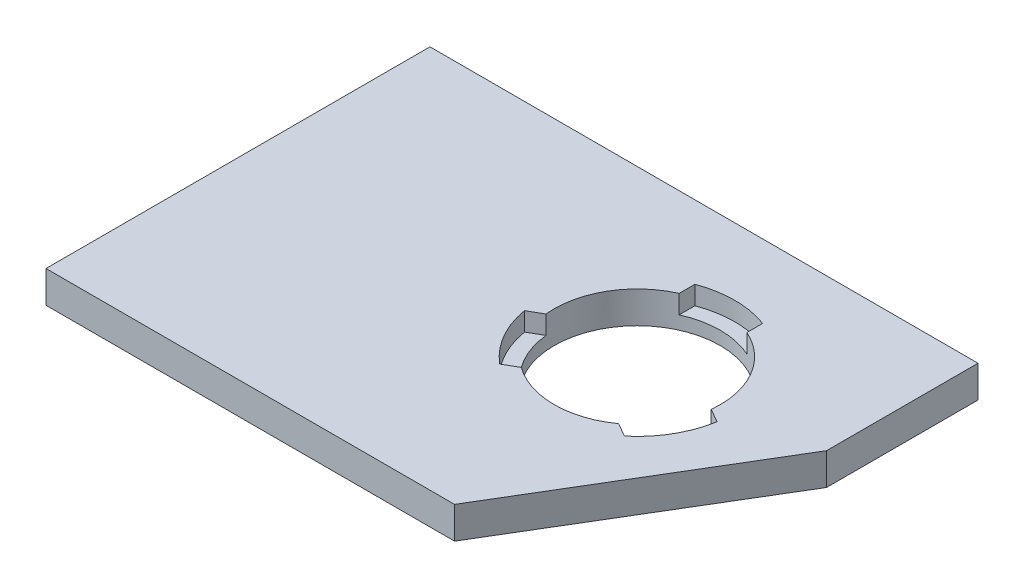
ISO-10303-21;
HEADER;
FILE_DESCRIPTION(('STEP AP214'),'2;1');
FILE_NAME('part.step','',(''),(''),'','','');
FILE_SCHEMA(('AUTOMOTIVE_DESIGN { 1 0 10303 214 1 1 1 1 }'));
ENDSEC;
DATA;
#1=APPLICATION_CONTEXT('core data for automotive mechanical design processes');
#2=APPLICATION_PROTOCOL_DEFINITION('international standard','automotive_design',2000,#1);
#3=PRODUCT_CONTEXT('',#1,'mechanical');
#4=PRODUCT('Part','Part','',(#3));
#5=PRODUCT_RELATED_PRODUCT_CATEGORY('part','',(#4));
#6=PRODUCT_DEFINITION_FORMATION('','',#4);
#7=PRODUCT_DEFINITION_CONTEXT('part definition',#1,'design');
#8=PRODUCT_DEFINITION('design','',#6,#7);
#9=PRODUCT_DEFINITION_SHAPE('','',#8);
#10=(LENGTH_UNIT() NAMED_UNIT(*) SI_UNIT(.MILLI.,.METRE.));
#11=(NAMED_UNIT(*) PLANE_ANGLE_UNIT() SI_UNIT($,.RADIAN.));
#12=(NAMED_UNIT(*) SI_UNIT($,.STERADIAN.) SOLID_ANGLE_UNIT());
#13=UNCERTAINTY_MEASURE_WITH_UNIT(LENGTH_MEASURE(1.E-05),#10,'distance_accuracy_value','');
#14=(GEOMETRIC_REPRESENTATION_CONTEXT(3) GLOBAL_UNCERTAINTY_ASSIGNED_CONTEXT((#13)) GLOBAL_UNIT_ASSIGNED_CONTEXT((#10,
#11,#12)) REPRESENTATION_CONTEXT('',''));
#15=CARTESIAN_POINT('',(0.,0.,0.));
#16=DIRECTION('',(0.,0.,1.));
#17=DIRECTION('',(1.,0.,0.));
#18=AXIS2_PLACEMENT_3D('',#15,#16,#17);
#19=CARTESIAN_POINT('',(0.,4.8,0.));
#20=DIRECTION('',(0.,-1.,0.));
#21=DIRECTION('',(0.,0.,-1.));
#22=AXIS2_PLACEMENT_3D('',#19,#20,#21);
#23=PLANE('',#22);
#24=DIRECTION('',(1.,0.,0.));
#25=VECTOR('',#24,1.);
#26=CARTESIAN_POINT('',(-20.3661087866109,4.8,10.1640167364017));
#27=LINE('',#26,#25);
#28=CARTESIAN_POINT('',(-20.3661087866109,4.8,10.1640167364017));
#29=VERTEX_POINT('',#28);
#30=CARTESIAN_POINT('',(41.1338912133891,4.8,10.1640167364017));
#31=VERTEX_POINT('',#30);
#32=EDGE_CURVE('E296',#29,#31,#27,.T.);
#33=ORIENTED_EDGE('',*,*,#32,.T.);
#34=DIRECTION('',(-0.514495755427526,0.,0.857492925712544));
#35=VECTOR('',#34,1.);
#36=CARTESIAN_POINT('',(41.1338912133891,4.8,10.1640167364017));
#37=LINE('',#36,#35);
#38=CARTESIAN_POINT('',(62.1338912133891,4.8,-24.8359832635983));
#39=VERTEX_POINT('',#38);
#40=EDGE_CURVE('E271',#39,#31,#37,.T.);
#41=ORIENTED_EDGE('',*,*,#40,.F.);
#42=DIRECTION('',(0.,0.,-1.));
#43=VECTOR('',#42,1.);
#44=CARTESIAN_POINT('',(62.1338912133891,4.8,10.1640167364017));
#45=LINE('',#44,#43);
#46=CARTESIAN_POINT('',(62.1338912133891,4.8,-47.6359832635983));
#47=VERTEX_POINT('',#46);
#48=EDGE_CURVE('E301',#39,#47,#45,.T.);
#49=ORIENTED_EDGE('',*,*,#48,.T.);
#50=DIRECTION('',(-1.,0.,0.));
#51=VECTOR('',#50,1.);
#52=CARTESIAN_POINT('',(-20.3661087866109,4.8,-47.6359832635983));
#53=LINE('',#52,#51);
#54=CARTESIAN_POINT('',(-20.3661087866109,4.8,-47.6359832635983));
#55=VERTEX_POINT('',#54);
#56=EDGE_CURVE('E304',#47,#55,#53,.T.);
#57=ORIENTED_EDGE('',*,*,#56,.T.);
#58=DIRECTION('',(0.,0.,1.));
#59=VECTOR('',#58,1.);
#60=CARTESIAN_POINT('',(-20.3661087866109,4.8,10.1640167364017));
#61=LINE('',#60,#59);
#62=EDGE_CURVE('E292',#55,#29,#61,.T.);
#63=ORIENTED_EDGE('',*,*,#62,.T.);
#64=EDGE_LOOP('',(#33,#41,#49,#57,#63));
#65=FACE_BOUND('',#64,.T.);
#66=DIRECTION('',(0.,0.,-1.));
#67=VECTOR('',#66,1.);
#68=CARTESIAN_POINT('',(30.5338912133891,4.8,0.));
#69=LINE('',#68,#67);
#70=CARTESIAN_POINT('',(30.5338912133891,4.8,-34.248257357748));
#71=VERTEX_POINT('',#70);
#72=CARTESIAN_POINT('',(30.5338912133891,4.8,-36.6229336152896));
#73=VERTEX_POINT('',#72);
#74=EDGE_CURVE('E176',#71,#73,#69,.T.);
#75=ORIENTED_EDGE('',*,*,#74,.T.);
#76=CARTESIAN_POINT('',(35.6338912133891,4.8,-22.8359832635983));
#77=DIRECTION('',(0.,1.,0.));
#78=DIRECTION('',(0.,0.,1.));
#79=AXIS2_PLACEMENT_3D('',#76,#77,#78);
#80=CIRCLE('',#79,14.7);
#81=CARTESIAN_POINT('',(40.7338912133891,4.8,-36.6229336152896));
#82=VERTEX_POINT('',#81);
#83=EDGE_CURVE('E539',#82,#73,#80,.T.);
#84=ORIENTED_EDGE('',*,*,#83,.F.);
#85=DIRECTION('',(0.,0.,1.));
#86=VECTOR('',#85,1.);
#87=CARTESIAN_POINT('',(40.7338912133891,4.8,0.));
#88=LINE('',#87,#86);
#89=CARTESIAN_POINT('',(40.7338912133891,4.8,-34.248257357748));
#90=VERTEX_POINT('',#89);
#91=EDGE_CURVE('E220',#82,#90,#88,.T.);
#92=ORIENTED_EDGE('',*,*,#91,.T.);
#93=CARTESIAN_POINT('',(35.6338912133891,4.8,-22.8359832635983));
#94=DIRECTION('',(0.,1.,0.));
#95=DIRECTION('',(0.,0.,1.));
#96=AXIS2_PLACEMENT_3D('',#93,#94,#95);
#97=CIRCLE('',#96,12.5);
#98=CARTESIAN_POINT('',(48.0672104938738,4.8,-21.5465757758243));
#99=VERTEX_POINT('',#98);
#100=EDGE_CURVE('E182',#99,#90,#97,.T.);
#101=ORIENTED_EDGE('',*,*,#100,.F.);
#102=DIRECTION('',(0.866025403784437,0.,0.500000000000003));
#103=VECTOR('',#102,1.);
#104=CARTESIAN_POINT('',(21.3467436166838,4.8,-36.9736445202426));
#105=LINE('',#104,#103);
#106=CARTESIAN_POINT('',(50.1237404586686,4.8,-20.3592376470535));
#107=VERTEX_POINT('',#106);
#108=EDGE_CURVE('E196',#99,#107,#105,.T.);
#109=ORIENTED_EDGE('',*,*,#108,.T.);
#110=CARTESIAN_POINT('',(35.6338912133891,4.8,-22.8359832635983));
#111=DIRECTION('',(0.,1.,0.));
#112=DIRECTION('',(0.,0.,1.));
#113=AXIS2_PLACEMENT_3D('',#110,#111,#112);
#114=CIRCLE('',#113,14.7);
#115=CARTESIAN_POINT('',(45.0237404586687,4.8,-11.5257785284522));
#116=VERTEX_POINT('',#115);
#117=EDGE_CURVE('E209',#116,#107,#114,.T.);
#118=ORIENTED_EDGE('',*,*,#117,.F.);
#119=DIRECTION('',(-0.866025403784437,0.,-0.500000000000004));
#120=VECTOR('',#119,1.);
#121=CARTESIAN_POINT('',(16.2467436166838,4.8,-28.1401854016413));
#122=LINE('',#121,#120);
#123=CARTESIAN_POINT('',(42.967210493874,4.8,-12.713116657223));
#124=VERTEX_POINT('',#123);
#125=EDGE_CURVE('E205',#116,#124,#122,.T.);
#126=ORIENTED_EDGE('',*,*,#125,.T.);
#127=CARTESIAN_POINT('',(28.3005719329048,4.8,-12.7131166572226));
#128=VERTEX_POINT('',#127);
#129=EDGE_CURVE('E272',#128,#124,#97,.T.);
#130=ORIENTED_EDGE('',*,*,#129,.F.);
#131=DIRECTION('',(-0.866025403784444,0.,0.499999999999992));
#132=VECTOR('',#131,1.);
#133=CARTESIAN_POINT('',(1.57020199001108,4.8,2.71966962484501));
#134=LINE('',#133,#132);
#135=CARTESIAN_POINT('',(26.24404196811,4.8,-11.5257785284518));
#136=VERTEX_POINT('',#135);
#137=EDGE_CURVE('E233',#128,#136,#134,.T.);
#138=ORIENTED_EDGE('',*,*,#137,.T.);
#139=CARTESIAN_POINT('',(35.6338912133891,4.8,-22.8359832635983));
#140=DIRECTION('',(0.,1.,0.));
#141=DIRECTION('',(0.,0.,1.));
#142=AXIS2_PLACEMENT_3D('',#139,#140,#141);
#143=CIRCLE('',#142,14.7);
#144=CARTESIAN_POINT('',(21.1440419681098,4.8,-20.359237647053));
#145=VERTEX_POINT('',#144);
#146=EDGE_CURVE('E249',#145,#136,#143,.T.);
#147=ORIENTED_EDGE('',*,*,#146,.F.);
#148=DIRECTION('',(0.866025403784443,0.,-0.499999999999992));
#149=VECTOR('',#148,1.);
#150=CARTESIAN_POINT('',(-3.52979800998883,4.8,-6.1137894937563));
#151=LINE('',#150,#149);
#152=CARTESIAN_POINT('',(23.2005719329045,4.8,-21.5465757758237));
#153=VERTEX_POINT('',#152);
#154=EDGE_CURVE('E245',#145,#153,#151,.T.);
#155=ORIENTED_EDGE('',*,*,#154,.T.);
#156=EDGE_CURVE('E276',#71,#153,#97,.T.);
#157=ORIENTED_EDGE('',*,*,#156,.F.);
#158=EDGE_LOOP('',(#75,#84,#92,#101,#109,#118,#126,#130,#138,#147,#155,#157));
#159=FACE_BOUND('',#158,.T.);
#160=ADVANCED_FACE('F38',(#65,#159),#23,.F.);
#161=CARTESIAN_POINT('',(35.6338912133891,0.,-22.8359832635983));
#162=DIRECTION('',(0.,1.,0.));
#163=DIRECTION('',(0.,0.,1.));
#164=AXIS2_PLACEMENT_3D('',#161,#162,#163);
#165=CYLINDRICAL_SURFACE('',#164,12.5);
#166=CARTESIAN_POINT('',(35.6338912133891,0.,-22.8359832635983));
#167=DIRECTION('',(0.,1.,0.));
#168=DIRECTION('',(0.,0.,1.));
#169=AXIS2_PLACEMENT_3D('',#166,#167,#168);
#170=CIRCLE('',#169,12.5);
#171=CARTESIAN_POINT('',(35.6338912133891,0.,-10.3359832635983));
#172=VERTEX_POINT('',#171);
#173=EDGE_CURVE('E267',#172,#172,#170,.T.);
#174=ORIENTED_EDGE('',*,*,#173,.F.);
#175=EDGE_LOOP('',(#174));
#176=FACE_BOUND('',#175,.T.);
#177=DIRECTION('',(0.,1.,0.));
#178=VECTOR('',#177,1.);
#179=CARTESIAN_POINT('',(30.5338912133891,2.,-34.248257357748));
#180=LINE('',#179,#178);
#181=CARTESIAN_POINT('',(30.5338912133891,2.,-34.248257357748));
#182=VERTEX_POINT('',#181);
#183=EDGE_CURVE('E277',#182,#71,#180,.T.);
#184=ORIENTED_EDGE('',*,*,#183,.T.);
#185=ORIENTED_EDGE('',*,*,#156,.T.);
#186=DIRECTION('',(0.,1.,0.));
#187=VECTOR('',#186,1.);
#188=CARTESIAN_POINT('',(23.2005719329045,2.,-21.5465757758237));
#189=LINE('',#188,#187);
#190=CARTESIAN_POINT('',(23.2005719329045,2.,-21.5465757758237));
#191=VERTEX_POINT('',#190);
#192=EDGE_CURVE('E210',#191,#153,#189,.T.);
#193=ORIENTED_EDGE('',*,*,#192,.F.);
#194=CARTESIAN_POINT('',(35.6338912133891,2.,-22.8359832635983));
#195=DIRECTION('',(0.,1.,0.));
#196=DIRECTION('',(0.,0.,1.));
#197=AXIS2_PLACEMENT_3D('',#194,#195,#196);
#198=CIRCLE('',#197,12.5);
#199=CARTESIAN_POINT('',(28.3005719329048,2.,-12.7131166572226));
#200=VERTEX_POINT('',#199);
#201=EDGE_CURVE('E240',#200,#191,#198,.F.);
#202=ORIENTED_EDGE('',*,*,#201,.F.);
#203=DIRECTION('',(0.,1.,0.));
#204=VECTOR('',#203,1.);
#205=CARTESIAN_POINT('',(28.3005719329048,2.,-12.7131166572226));
#206=LINE('',#205,#204);
#207=EDGE_CURVE('E258',#200,#128,#206,.T.);
#208=ORIENTED_EDGE('',*,*,#207,.T.);
#209=ORIENTED_EDGE('',*,*,#129,.T.);
#210=DIRECTION('',(0.,1.,0.));
#211=VECTOR('',#210,1.);
#212=CARTESIAN_POINT('',(42.967210493874,2.,-12.713116657223));
#213=LINE('',#212,#211);
#214=CARTESIAN_POINT('',(42.967210493874,2.,-12.713116657223));
#215=VERTEX_POINT('',#214);
#216=EDGE_CURVE('E204',#215,#124,#213,.T.);
#217=ORIENTED_EDGE('',*,*,#216,.F.);
#218=CARTESIAN_POINT('',(35.6338912133891,2.,-22.8359832635983));
#219=DIRECTION('',(0.,1.,0.));
#220=DIRECTION('',(0.,0.,1.));
#221=AXIS2_PLACEMENT_3D('',#218,#219,#220);
#222=CIRCLE('',#221,12.5);
#223=CARTESIAN_POINT('',(48.0672104938738,2.,-21.5465757758243));
#224=VERTEX_POINT('',#223);
#225=EDGE_CURVE('E192',#224,#215,#222,.F.);
#226=ORIENTED_EDGE('',*,*,#225,.F.);
#227=DIRECTION('',(0.,1.,0.));
#228=VECTOR('',#227,1.);
#229=CARTESIAN_POINT('',(48.0672104938738,2.,-21.5465757758243));
#230=LINE('',#229,#228);
#231=EDGE_CURVE('E217',#224,#99,#230,.T.);
#232=ORIENTED_EDGE('',*,*,#231,.T.);
#233=ORIENTED_EDGE('',*,*,#100,.T.);
#234=DIRECTION('',(0.,1.,0.));
#235=VECTOR('',#234,1.);
#236=CARTESIAN_POINT('',(40.7338912133891,2.,-34.248257357748));
#237=LINE('',#236,#235);
#238=CARTESIAN_POINT('',(40.7338912133891,2.,-34.248257357748));
#239=VERTEX_POINT('',#238);
#240=EDGE_CURVE('E163',#239,#90,#237,.T.);
#241=ORIENTED_EDGE('',*,*,#240,.F.);
#242=CARTESIAN_POINT('',(35.6338912133891,2.,-22.8359832635983));
#243=DIRECTION('',(0.,1.,0.));
#244=DIRECTION('',(0.,0.,1.));
#245=AXIS2_PLACEMENT_3D('',#242,#243,#244);
#246=CIRCLE('',#245,12.5);
#247=EDGE_CURVE('E169',#182,#239,#246,.F.);
#248=ORIENTED_EDGE('',*,*,#247,.F.);
#249=EDGE_LOOP('',(#184,#185,#193,#202,#208,#209,#217,#226,#232,#233,#241,#248));
#250=FACE_BOUND('',#249,.T.);
#251=ADVANCED_FACE('F179',(#176,#250),#165,.F.);
#252=CARTESIAN_POINT('',(-20.3661087866109,4.8,10.1640167364017));
#253=DIRECTION('',(1.,0.,0.));
#254=DIRECTION('',(0.,0.,-1.));
#255=AXIS2_PLACEMENT_3D('',#252,#253,#254);
#256=PLANE('',#255);
#257=DIRECTION('',(0.,0.,1.));
#258=VECTOR('',#257,1.);
#259=CARTESIAN_POINT('',(-20.3661087866109,0.,10.1640167364017));
#260=LINE('',#259,#258);
#261=CARTESIAN_POINT('',(-20.3661087866109,0.,-47.6359832635983));
#262=VERTEX_POINT('',#261);
#263=CARTESIAN_POINT('',(-20.3661087866109,0.,10.1640167364017));
#264=VERTEX_POINT('',#263);
#265=EDGE_CURVE('E289',#262,#264,#260,.T.);
#266=ORIENTED_EDGE('',*,*,#265,.T.);
#267=DIRECTION('',(0.,-1.,0.));
#268=VECTOR('',#267,1.);
#269=CARTESIAN_POINT('',(-20.3661087866109,4.8,10.1640167364017));
#270=LINE('',#269,#268);
#271=EDGE_CURVE('E11',#29,#264,#270,.T.);
#272=ORIENTED_EDGE('',*,*,#271,.F.);
#273=ORIENTED_EDGE('',*,*,#62,.F.);
#274=DIRECTION('',(0.,-1.,0.));
#275=VECTOR('',#274,1.);
#276=CARTESIAN_POINT('',(-20.3661087866109,4.8,-47.6359832635983));
#277=LINE('',#276,#275);
#278=EDGE_CURVE('E307',#55,#262,#277,.T.);
#279=ORIENTED_EDGE('',*,*,#278,.T.);
#280=EDGE_LOOP('',(#266,#272,#273,#279));
#281=FACE_BOUND('',#280,.T.);
#282=ADVANCED_FACE('F40',(#281),#256,.F.);
#283=CARTESIAN_POINT('',(-20.3661087866109,4.8,10.1640167364017));
#284=DIRECTION('',(0.,0.,-1.));
#285=DIRECTION('',(-1.,0.,0.));
#286=AXIS2_PLACEMENT_3D('',#283,#284,#285);
#287=PLANE('',#286);
#288=DIRECTION('',(1.,0.,0.));
#289=VECTOR('',#288,1.);
#290=CARTESIAN_POINT('',(-20.3661087866109,0.,10.1640167364017));
#291=LINE('',#290,#289);
#292=CARTESIAN_POINT('',(41.1338912133891,0.,10.1640167364017));
#293=VERTEX_POINT('',#292);
#294=EDGE_CURVE('E311',#264,#293,#291,.T.);
#295=ORIENTED_EDGE('',*,*,#294,.T.);
#296=DIRECTION('',(0.,1.,0.));
#297=VECTOR('',#296,1.);
#298=CARTESIAN_POINT('',(41.1338912133891,0.,10.1640167364017));
#299=LINE('',#298,#297);
#300=EDGE_CURVE('E285',#293,#31,#299,.T.);
#301=ORIENTED_EDGE('',*,*,#300,.T.);
#302=ORIENTED_EDGE('',*,*,#32,.F.);
#303=ORIENTED_EDGE('',*,*,#271,.T.);
#304=EDGE_LOOP('',(#295,#301,#302,#303));
#305=FACE_BOUND('',#304,.T.);
#306=ADVANCED_FACE('F347',(#305),#287,.F.);
#307=CARTESIAN_POINT('',(62.1338912133891,4.8,10.1640167364017));
#308=DIRECTION('',(-1.,0.,0.));
#309=DIRECTION('',(0.,0.,1.));
#310=AXIS2_PLACEMENT_3D('',#307,#308,#309);
#311=PLANE('',#310);
#312=ORIENTED_EDGE('',*,*,#48,.F.);
#313=DIRECTION('',(0.,1.,0.));
#314=VECTOR('',#313,1.);
#315=CARTESIAN_POINT('',(62.1338912133891,0.,-24.8359832635983));
#316=LINE('',#315,#314);
#317=CARTESIAN_POINT('',(62.1338912133891,0.,-24.8359832635983));
#318=VERTEX_POINT('',#317);
#319=EDGE_CURVE('E282',#318,#39,#316,.T.);
#320=ORIENTED_EDGE('',*,*,#319,.F.);
#321=DIRECTION('',(0.,0.,-1.));
#322=VECTOR('',#321,1.);
#323=CARTESIAN_POINT('',(62.1338912133891,0.,10.1640167364017));
#324=LINE('',#323,#322);
#325=CARTESIAN_POINT('',(62.1338912133891,0.,-47.6359832635983));
#326=VERTEX_POINT('',#325);
#327=EDGE_CURVE('E315',#318,#326,#324,.T.);
#328=ORIENTED_EDGE('',*,*,#327,.T.);
#329=DIRECTION('',(0.,-1.,0.));
#330=VECTOR('',#329,1.);
#331=CARTESIAN_POINT('',(62.1338912133891,4.8,-47.6359832635983));
#332=LINE('',#331,#330);
#333=EDGE_CURVE('E47',#47,#326,#332,.T.);
#334=ORIENTED_EDGE('',*,*,#333,.F.);
#335=EDGE_LOOP('',(#312,#320,#328,#334));
#336=FACE_BOUND('',#335,.T.);
#337=ADVANCED_FACE('F343',(#336),#311,.F.);
#338=CARTESIAN_POINT('',(-20.3661087866109,4.8,-47.6359832635983));
#339=DIRECTION('',(0.,0.,1.));
#340=DIRECTION('',(1.,0.,0.));
#341=AXIS2_PLACEMENT_3D('',#338,#339,#340);
#342=PLANE('',#341);
#343=DIRECTION('',(-1.,0.,0.));
#344=VECTOR('',#343,1.);
#345=CARTESIAN_POINT('',(-20.3661087866109,0.,-47.6359832635983));
#346=LINE('',#345,#344);
#347=EDGE_CURVE('E297',#326,#262,#346,.T.);
#348=ORIENTED_EDGE('',*,*,#347,.T.);
#349=ORIENTED_EDGE('',*,*,#278,.F.);
#350=ORIENTED_EDGE('',*,*,#56,.F.);
#351=ORIENTED_EDGE('',*,*,#333,.T.);
#352=EDGE_LOOP('',(#348,#349,#350,#351));
#353=FACE_BOUND('',#352,.T.);
#354=ADVANCED_FACE('F328',(#353),#342,.F.);
#355=CARTESIAN_POINT('',(0.,0.,0.));
#356=DIRECTION('',(0.,-1.,0.));
#357=DIRECTION('',(0.,0.,-1.));
#358=AXIS2_PLACEMENT_3D('',#355,#356,#357);
#359=PLANE('',#358);
#360=ORIENTED_EDGE('',*,*,#173,.T.);
#361=EDGE_LOOP('',(#360));
#362=FACE_BOUND('',#361,.T.);
#363=DIRECTION('',(-0.514495755427526,0.,0.857492925712544));
#364=VECTOR('',#363,1.);
#365=CARTESIAN_POINT('',(41.1338912133891,0.,10.1640167364017));
#366=LINE('',#365,#364);
#367=EDGE_CURVE('E278',#318,#293,#366,.T.);
#368=ORIENTED_EDGE('',*,*,#367,.T.);
#369=ORIENTED_EDGE('',*,*,#294,.F.);
#370=ORIENTED_EDGE('',*,*,#265,.F.);
#371=ORIENTED_EDGE('',*,*,#347,.F.);
#372=ORIENTED_EDGE('',*,*,#327,.F.);
#373=EDGE_LOOP('',(#368,#369,#370,#371,#372));
#374=FACE_BOUND('',#373,.T.);
#375=ADVANCED_FACE('F335',(#362,#374),#359,.T.);
#376=CARTESIAN_POINT('',(41.1338912133891,0.,10.1640167364017));
#377=DIRECTION('',(-0.857492925712544,0.,-0.514495755427526));
#378=DIRECTION('',(-0.514495755427527,0.,0.857492925712544));
#379=AXIS2_PLACEMENT_3D('',#376,#377,#378);
#380=PLANE('',#379);
#381=ORIENTED_EDGE('',*,*,#40,.T.);
#382=ORIENTED_EDGE('',*,*,#300,.F.);
#383=ORIENTED_EDGE('',*,*,#367,.F.);
#384=ORIENTED_EDGE('',*,*,#319,.T.);
#385=EDGE_LOOP('',(#381,#382,#383,#384));
#386=FACE_BOUND('',#385,.T.);
#387=ADVANCED_FACE('F345',(#386),#380,.F.);
#388=CARTESIAN_POINT('',(-3.52979800998883,2.,-6.1137894937563));
#389=DIRECTION('',(0.499999999999992,0.,0.866025403784443));
#390=DIRECTION('',(0.866025403784443,0.,-0.499999999999992));
#391=AXIS2_PLACEMENT_3D('',#388,#389,#390);
#392=PLANE('',#391);
#393=ORIENTED_EDGE('',*,*,#154,.F.);
#394=DIRECTION('',(0.,1.,0.));
#395=VECTOR('',#394,1.);
#396=CARTESIAN_POINT('',(21.1440419681098,2.,-20.359237647053));
#397=LINE('',#396,#395);
#398=CARTESIAN_POINT('',(21.1440419681098,2.,-20.359237647053));
#399=VERTEX_POINT('',#398);
#400=EDGE_CURVE('E244',#399,#145,#397,.T.);
#401=ORIENTED_EDGE('',*,*,#400,.F.);
#402=DIRECTION('',(0.866025403784443,0.,-0.499999999999992));
#403=VECTOR('',#402,1.);
#404=CARTESIAN_POINT('',(-3.52979800998883,2.,-6.1137894937563));
#405=LINE('',#404,#403);
#406=EDGE_CURVE('E229',#399,#191,#405,.T.);
#407=ORIENTED_EDGE('',*,*,#406,.T.);
#408=ORIENTED_EDGE('',*,*,#192,.T.);
#409=EDGE_LOOP('',(#393,#401,#407,#408));
#410=FACE_BOUND('',#409,.T.);
#411=ADVANCED_FACE('F382',(#410),#392,.T.);
#412=CARTESIAN_POINT('',(1.57020199001108,2.,2.71966962484501));
#413=DIRECTION('',(-0.499999999999992,0.,-0.866025403784444));
#414=DIRECTION('',(-0.866025403784444,0.,0.499999999999992));
#415=AXIS2_PLACEMENT_3D('',#412,#413,#414);
#416=PLANE('',#415);
#417=ORIENTED_EDGE('',*,*,#137,.F.);
#418=ORIENTED_EDGE('',*,*,#207,.F.);
#419=DIRECTION('',(-0.866025403784444,0.,0.499999999999992));
#420=VECTOR('',#419,1.);
#421=CARTESIAN_POINT('',(1.57020199001108,2.,2.71966962484501));
#422=LINE('',#421,#420);
#423=CARTESIAN_POINT('',(26.24404196811,2.,-11.5257785284518));
#424=VERTEX_POINT('',#423);
#425=EDGE_CURVE('E237',#200,#424,#422,.T.);
#426=ORIENTED_EDGE('',*,*,#425,.T.);
#427=DIRECTION('',(0.,1.,0.));
#428=VECTOR('',#427,1.);
#429=CARTESIAN_POINT('',(26.24404196811,2.,-11.5257785284518));
#430=LINE('',#429,#428);
#431=EDGE_CURVE('E262',#424,#136,#430,.T.);
#432=ORIENTED_EDGE('',*,*,#431,.T.);
#433=EDGE_LOOP('',(#417,#418,#426,#432));
#434=FACE_BOUND('',#433,.T.);
#435=ADVANCED_FACE('F388',(#434),#416,.T.);
#436=CARTESIAN_POINT('',(35.6338912133891,2.,-22.8359832635983));
#437=DIRECTION('',(0.,1.,0.));
#438=DIRECTION('',(0.,0.,1.));
#439=AXIS2_PLACEMENT_3D('',#436,#437,#438);
#440=CYLINDRICAL_SURFACE('',#439,14.7);
#441=ORIENTED_EDGE('',*,*,#146,.T.);
#442=ORIENTED_EDGE('',*,*,#431,.F.);
#443=CARTESIAN_POINT('',(35.6338912133891,2.,-22.8359832635983));
#444=DIRECTION('',(0.,1.,0.));
#445=DIRECTION('',(0.,0.,1.));
#446=AXIS2_PLACEMENT_3D('',#443,#444,#445);
#447=CIRCLE('',#446,14.7);
#448=EDGE_CURVE('E232',#399,#424,#447,.T.);
#449=ORIENTED_EDGE('',*,*,#448,.F.);
#450=ORIENTED_EDGE('',*,*,#400,.T.);
#451=EDGE_LOOP('',(#441,#442,#449,#450));
#452=FACE_BOUND('',#451,.T.);
#453=ADVANCED_FACE('F397',(#452),#440,.F.);
#454=CARTESIAN_POINT('',(0.,2.,0.));
#455=DIRECTION('',(0.,1.,0.));
#456=DIRECTION('',(0.,0.,1.));
#457=AXIS2_PLACEMENT_3D('',#454,#455,#456);
#458=PLANE('',#457);
#459=ORIENTED_EDGE('',*,*,#406,.F.);
#460=ORIENTED_EDGE('',*,*,#448,.T.);
#461=ORIENTED_EDGE('',*,*,#425,.F.);
#462=ORIENTED_EDGE('',*,*,#201,.T.);
#463=EDGE_LOOP('',(#459,#460,#461,#462));
#464=FACE_BOUND('',#463,.T.);
#465=ADVANCED_FACE('F405',(#464),#458,.T.);
#466=CARTESIAN_POINT('',(21.3467436166838,2.,-36.9736445202426));
#467=DIRECTION('',(-0.500000000000003,0.,0.866025403784437));
#468=DIRECTION('',(0.866025403784437,0.,0.500000000000003));
#469=AXIS2_PLACEMENT_3D('',#466,#467,#468);
#470=PLANE('',#469);
#471=ORIENTED_EDGE('',*,*,#108,.F.);
#472=ORIENTED_EDGE('',*,*,#231,.F.);
#473=DIRECTION('',(0.866025403784437,0.,0.500000000000003));
#474=VECTOR('',#473,1.);
#475=CARTESIAN_POINT('',(21.3467436166838,2.,-36.9736445202426));
#476=LINE('',#475,#474);
#477=CARTESIAN_POINT('',(50.1237404586686,2.,-20.3592376470535));
#478=VERTEX_POINT('',#477);
#479=EDGE_CURVE('E62',#224,#478,#476,.T.);
#480=ORIENTED_EDGE('',*,*,#479,.T.);
#481=DIRECTION('',(0.,1.,0.));
#482=VECTOR('',#481,1.);
#483=CARTESIAN_POINT('',(50.1237404586686,2.,-20.3592376470535));
#484=LINE('',#483,#482);
#485=EDGE_CURVE('E221',#478,#107,#484,.T.);
#486=ORIENTED_EDGE('',*,*,#485,.T.);
#487=EDGE_LOOP('',(#471,#472,#480,#486));
#488=FACE_BOUND('',#487,.T.);
#489=ADVANCED_FACE('F413',(#488),#470,.T.);
#490=CARTESIAN_POINT('',(35.6338912133891,2.,-22.8359832635983));
#491=DIRECTION('',(0.,1.,0.));
#492=DIRECTION('',(0.,0.,1.));
#493=AXIS2_PLACEMENT_3D('',#490,#491,#492);
#494=CYLINDRICAL_SURFACE('',#493,14.7);
#495=ORIENTED_EDGE('',*,*,#117,.T.);
#496=ORIENTED_EDGE('',*,*,#485,.F.);
#497=CARTESIAN_POINT('',(35.6338912133891,2.,-22.8359832635983));
#498=DIRECTION('',(0.,1.,0.));
#499=DIRECTION('',(0.,0.,1.));
#500=AXIS2_PLACEMENT_3D('',#497,#498,#499);
#501=CIRCLE('',#500,14.7);
#502=CARTESIAN_POINT('',(45.0237404586687,2.,-11.5257785284522));
#503=VERTEX_POINT('',#502);
#504=EDGE_CURVE('E199',#503,#478,#501,.T.);
#505=ORIENTED_EDGE('',*,*,#504,.F.);
#506=DIRECTION('',(0.,1.,0.));
#507=VECTOR('',#506,1.);
#508=CARTESIAN_POINT('',(45.0237404586687,2.,-11.5257785284522));
#509=LINE('',#508,#507);
#510=EDGE_CURVE('E224',#503,#116,#509,.T.);
#511=ORIENTED_EDGE('',*,*,#510,.T.);
#512=EDGE_LOOP('',(#495,#496,#505,#511));
#513=FACE_BOUND('',#512,.T.);
#514=ADVANCED_FACE('F421',(#513),#494,.F.);
#515=CARTESIAN_POINT('',(16.2467436166838,2.,-28.1401854016413));
#516=DIRECTION('',(0.500000000000004,0.,-0.866025403784437));
#517=DIRECTION('',(-0.866025403784436,0.,-0.500000000000004));
#518=AXIS2_PLACEMENT_3D('',#515,#516,#517);
#519=PLANE('',#518);
#520=ORIENTED_EDGE('',*,*,#125,.F.);
#521=ORIENTED_EDGE('',*,*,#510,.F.);
#522=DIRECTION('',(-0.866025403784437,0.,-0.500000000000004));
#523=VECTOR('',#522,1.);
#524=CARTESIAN_POINT('',(16.2467436166838,2.,-28.1401854016413));
#525=LINE('',#524,#523);
#526=EDGE_CURVE('E195',#503,#215,#525,.T.);
#527=ORIENTED_EDGE('',*,*,#526,.T.);
#528=ORIENTED_EDGE('',*,*,#216,.T.);
#529=EDGE_LOOP('',(#520,#521,#527,#528));
#530=FACE_BOUND('',#529,.T.);
#531=ADVANCED_FACE('F429',(#530),#519,.T.);
#532=CARTESIAN_POINT('',(0.,2.,0.));
#533=DIRECTION('',(0.,1.,0.));
#534=DIRECTION('',(0.,0.,1.));
#535=AXIS2_PLACEMENT_3D('',#532,#533,#534);
#536=PLANE('',#535);
#537=ORIENTED_EDGE('',*,*,#225,.T.);
#538=ORIENTED_EDGE('',*,*,#526,.F.);
#539=ORIENTED_EDGE('',*,*,#504,.T.);
#540=ORIENTED_EDGE('',*,*,#479,.F.);
#541=EDGE_LOOP('',(#537,#538,#539,#540));
#542=FACE_BOUND('',#541,.T.);
#543=ADVANCED_FACE('F437',(#542),#536,.T.);
#544=CARTESIAN_POINT('',(30.5338912133891,2.,0.));
#545=DIRECTION('',(1.,0.,0.));
#546=DIRECTION('',(0.,0.,-1.));
#547=AXIS2_PLACEMENT_3D('',#544,#545,#546);
#548=PLANE('',#547);
#549=ORIENTED_EDGE('',*,*,#74,.F.);
#550=ORIENTED_EDGE('',*,*,#183,.F.);
#551=DIRECTION('',(0.,0.,-1.));
#552=VECTOR('',#551,1.);
#553=CARTESIAN_POINT('',(30.5338912133891,2.,0.));
#554=LINE('',#553,#552);
#555=CARTESIAN_POINT('',(30.5338912133891,2.,-36.6229336152896));
#556=VERTEX_POINT('',#555);
#557=EDGE_CURVE('E54',#182,#556,#554,.T.);
#558=ORIENTED_EDGE('',*,*,#557,.T.);
#559=DIRECTION('',(0.,1.,0.));
#560=VECTOR('',#559,1.);
#561=CARTESIAN_POINT('',(30.5338912133891,2.,-36.6229336152896));
#562=LINE('',#561,#560);
#563=EDGE_CURVE('E187',#556,#73,#562,.T.);
#564=ORIENTED_EDGE('',*,*,#563,.T.);
#565=EDGE_LOOP('',(#549,#550,#558,#564));
#566=FACE_BOUND('',#565,.T.);
#567=ADVANCED_FACE('F445',(#566),#548,.T.);
#568=CARTESIAN_POINT('',(35.6338912133891,2.,-22.8359832635983));
#569=DIRECTION('',(0.,1.,0.));
#570=DIRECTION('',(0.,0.,1.));
#571=AXIS2_PLACEMENT_3D('',#568,#569,#570);
#572=CYLINDRICAL_SURFACE('',#571,14.7);
#573=ORIENTED_EDGE('',*,*,#83,.T.);
#574=ORIENTED_EDGE('',*,*,#563,.F.);
#575=CARTESIAN_POINT('',(35.6338912133891,2.,-22.8359832635983));
#576=DIRECTION('',(0.,1.,0.));
#577=DIRECTION('',(0.,0.,1.));
#578=AXIS2_PLACEMENT_3D('',#575,#576,#577);
#579=CIRCLE('',#578,14.7);
#580=CARTESIAN_POINT('',(40.7338912133891,2.,-36.6229336152896));
#581=VERTEX_POINT('',#580);
#582=EDGE_CURVE('E168',#581,#556,#579,.T.);
#583=ORIENTED_EDGE('',*,*,#582,.F.);
#584=DIRECTION('',(0.,1.,0.));
#585=VECTOR('',#584,1.);
#586=CARTESIAN_POINT('',(40.7338912133891,2.,-36.6229336152896));
#587=LINE('',#586,#585);
#588=EDGE_CURVE('E165',#581,#82,#587,.T.);
#589=ORIENTED_EDGE('',*,*,#588,.T.);
#590=EDGE_LOOP('',(#573,#574,#583,#589));
#591=FACE_BOUND('',#590,.T.);
#592=ADVANCED_FACE('F452',(#591),#572,.F.);
#593=CARTESIAN_POINT('',(40.7338912133891,2.,0.));
#594=DIRECTION('',(-1.,0.,0.));
#595=DIRECTION('',(0.,0.,1.));
#596=AXIS2_PLACEMENT_3D('',#593,#594,#595);
#597=PLANE('',#596);
#598=ORIENTED_EDGE('',*,*,#91,.F.);
#599=ORIENTED_EDGE('',*,*,#588,.F.);
#600=DIRECTION('',(0.,0.,1.));
#601=VECTOR('',#600,1.);
#602=CARTESIAN_POINT('',(40.7338912133891,2.,0.));
#603=LINE('',#602,#601);
#604=EDGE_CURVE('E159',#581,#239,#603,.T.);
#605=ORIENTED_EDGE('',*,*,#604,.T.);
#606=ORIENTED_EDGE('',*,*,#240,.T.);
#607=EDGE_LOOP('',(#598,#599,#605,#606));
#608=FACE_BOUND('',#607,.T.);
#609=ADVANCED_FACE('F161',(#608),#597,.T.);
#610=CARTESIAN_POINT('',(0.,2.,0.));
#611=DIRECTION('',(0.,1.,0.));
#612=DIRECTION('',(0.,0.,1.));
#613=AXIS2_PLACEMENT_3D('',#610,#611,#612);
#614=PLANE('',#613);
#615=ORIENTED_EDGE('',*,*,#247,.T.);
#616=ORIENTED_EDGE('',*,*,#604,.F.);
#617=ORIENTED_EDGE('',*,*,#582,.T.);
#618=ORIENTED_EDGE('',*,*,#557,.F.);
#619=EDGE_LOOP('',(#615,#616,#617,#618));
#620=FACE_BOUND('',#619,.T.);
#621=ADVANCED_FACE('F172',(#620),#614,.T.);
#622=CLOSED_SHELL('',(#160,#251,#282,#306,#337,#354,#375,#387,#411,#435,#453,#465,#489,#514,
#531,#543,#567,#592,#609,#621));
#623=MANIFOLD_SOLID_BREP('B2',#622);
#624=ADVANCED_BREP_SHAPE_REPRESENTATION('',(#18,#623),#14);
#625=SHAPE_DEFINITION_REPRESENTATION(#9,#624);
ENDSEC;
END-ISO-10303-21;
